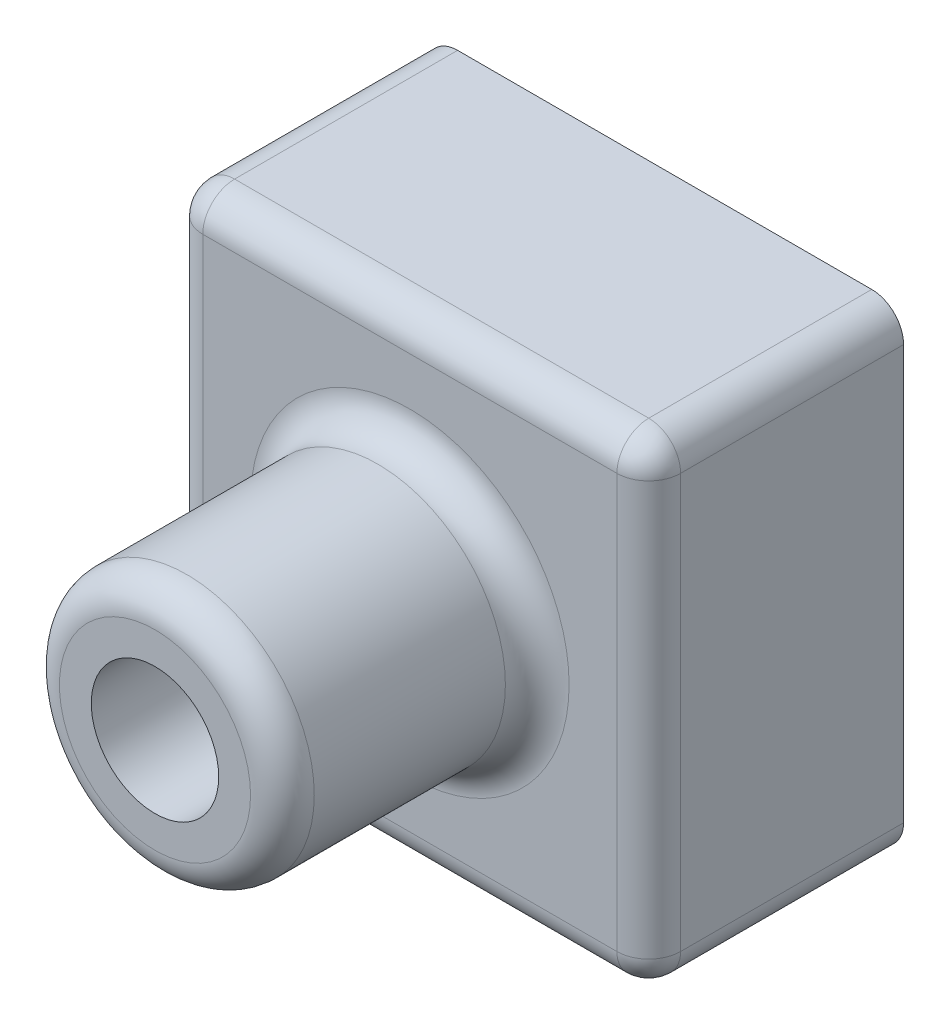
ISO-10303-21;
HEADER;
FILE_DESCRIPTION(('STEP AP214'),'2;1');
FILE_NAME('part.step','',(''),(''),'','','');
FILE_SCHEMA(('AUTOMOTIVE_DESIGN { 1 0 10303 214 1 1 1 1 }'));
ENDSEC;
DATA;
#1=APPLICATION_CONTEXT('core data for automotive mechanical design processes');
#2=APPLICATION_PROTOCOL_DEFINITION('international standard','automotive_design',2000,#1);
#3=PRODUCT_CONTEXT('',#1,'mechanical');
#4=PRODUCT('Part','Part','',(#3));
#5=PRODUCT_RELATED_PRODUCT_CATEGORY('part','',(#4));
#6=PRODUCT_DEFINITION_FORMATION('','',#4);
#7=PRODUCT_DEFINITION_CONTEXT('part definition',#1,'design');
#8=PRODUCT_DEFINITION('design','',#6,#7);
#9=PRODUCT_DEFINITION_SHAPE('','',#8);
#10=(LENGTH_UNIT() NAMED_UNIT(*) SI_UNIT(.MILLI.,.METRE.));
#11=(NAMED_UNIT(*) PLANE_ANGLE_UNIT() SI_UNIT($,.RADIAN.));
#12=(NAMED_UNIT(*) SI_UNIT($,.STERADIAN.) SOLID_ANGLE_UNIT());
#13=UNCERTAINTY_MEASURE_WITH_UNIT(LENGTH_MEASURE(1.E-05),#10,'distance_accuracy_value','');
#14=(GEOMETRIC_REPRESENTATION_CONTEXT(3) GLOBAL_UNCERTAINTY_ASSIGNED_CONTEXT((#13)) GLOBAL_UNIT_ASSIGNED_CONTEXT((#10,
#11,#12)) REPRESENTATION_CONTEXT('',''));
#15=CARTESIAN_POINT('',(0.,0.,0.));
#16=DIRECTION('',(0.,0.,1.));
#17=DIRECTION('',(1.,0.,0.));
#18=AXIS2_PLACEMENT_3D('',#15,#16,#17);
#19=CARTESIAN_POINT('',(37.5,37.5,40.));
#20=DIRECTION('',(-1.,0.,0.));
#21=DIRECTION('',(0.,0.,1.));
#22=AXIS2_PLACEMENT_3D('',#19,#20,#21);
#23=PLANE('',#22);
#24=DIRECTION('',(0.,1.,0.));
#25=VECTOR('',#24,1.);
#26=CARTESIAN_POINT('',(37.5,37.5,0.));
#27=LINE('',#26,#25);
#28=CARTESIAN_POINT('',(37.5,-32.5,0.));
#29=VERTEX_POINT('',#28);
#30=CARTESIAN_POINT('',(37.5,32.5,0.));
#31=VERTEX_POINT('',#30);
#32=EDGE_CURVE('E225',#29,#31,#27,.T.);
#33=ORIENTED_EDGE('',*,*,#32,.T.);
#34=DIRECTION('',(0.,0.,-1.));
#35=VECTOR('',#34,1.);
#36=CARTESIAN_POINT('',(37.5,32.5,40.));
#37=LINE('',#36,#35);
#38=CARTESIAN_POINT('',(37.5,32.5,35.));
#39=VERTEX_POINT('',#38);
#40=EDGE_CURVE('E249',#31,#39,#37,.F.);
#41=ORIENTED_EDGE('',*,*,#40,.T.);
#42=DIRECTION('',(0.,1.,0.));
#43=VECTOR('',#42,1.);
#44=CARTESIAN_POINT('',(37.5,-37.5,35.));
#45=LINE('',#44,#43);
#46=CARTESIAN_POINT('',(37.5,-32.5,35.));
#47=VERTEX_POINT('',#46);
#48=EDGE_CURVE('E245',#39,#47,#45,.F.);
#49=ORIENTED_EDGE('',*,*,#48,.T.);
#50=DIRECTION('',(0.,0.,-1.));
#51=VECTOR('',#50,1.);
#52=CARTESIAN_POINT('',(37.5,-32.5,40.));
#53=LINE('',#52,#51);
#54=EDGE_CURVE('E247',#47,#29,#53,.T.);
#55=ORIENTED_EDGE('',*,*,#54,.T.);
#56=EDGE_LOOP('',(#33,#41,#49,#55));
#57=FACE_BOUND('',#56,.T.);
#58=ADVANCED_FACE('F38',(#57),#23,.F.);
#59=CARTESIAN_POINT('',(-37.5,37.5,40.));
#60=DIRECTION('',(0.,-1.,0.));
#61=DIRECTION('',(0.,0.,-1.));
#62=AXIS2_PLACEMENT_3D('',#59,#60,#61);
#63=PLANE('',#62);
#64=DIRECTION('',(-1.,0.,0.));
#65=VECTOR('',#64,1.);
#66=CARTESIAN_POINT('',(-37.5,37.5,0.));
#67=LINE('',#66,#65);
#68=CARTESIAN_POINT('',(32.5,37.5,0.));
#69=VERTEX_POINT('',#68);
#70=CARTESIAN_POINT('',(-32.5,37.5,0.));
#71=VERTEX_POINT('',#70);
#72=EDGE_CURVE('E221',#69,#71,#67,.T.);
#73=ORIENTED_EDGE('',*,*,#72,.T.);
#74=DIRECTION('',(0.,0.,-1.));
#75=VECTOR('',#74,1.);
#76=CARTESIAN_POINT('',(-32.5,37.5,40.));
#77=LINE('',#76,#75);
#78=CARTESIAN_POINT('',(-32.5,37.5,35.));
#79=VERTEX_POINT('',#78);
#80=EDGE_CURVE('E198',#71,#79,#77,.F.);
#81=ORIENTED_EDGE('',*,*,#80,.T.);
#82=DIRECTION('',(-1.,0.,0.));
#83=VECTOR('',#82,1.);
#84=CARTESIAN_POINT('',(37.5,37.5,35.));
#85=LINE('',#84,#83);
#86=CARTESIAN_POINT('',(32.5,37.5,35.));
#87=VERTEX_POINT('',#86);
#88=EDGE_CURVE('E203',#79,#87,#85,.F.);
#89=ORIENTED_EDGE('',*,*,#88,.T.);
#90=DIRECTION('',(0.,0.,-1.));
#91=VECTOR('',#90,1.);
#92=CARTESIAN_POINT('',(32.5,37.5,40.));
#93=LINE('',#92,#91);
#94=EDGE_CURVE('E236',#87,#69,#93,.T.);
#95=ORIENTED_EDGE('',*,*,#94,.T.);
#96=EDGE_LOOP('',(#73,#81,#89,#95));
#97=FACE_BOUND('',#96,.T.);
#98=ADVANCED_FACE('F862',(#97),#63,.F.);
#99=CARTESIAN_POINT('',(-37.5,37.5,40.));
#100=DIRECTION('',(1.,0.,0.));
#101=DIRECTION('',(0.,1.,0.));
#102=AXIS2_PLACEMENT_3D('',#99,#100,#101);
#103=PLANE('',#102);
#104=DIRECTION('',(0.,-1.,0.));
#105=VECTOR('',#104,1.);
#106=CARTESIAN_POINT('',(-37.5,37.5,35.));
#107=LINE('',#106,#105);
#108=CARTESIAN_POINT('',(-37.5,-32.5,35.));
#109=VERTEX_POINT('',#108);
#110=CARTESIAN_POINT('',(-37.5,32.5,35.));
#111=VERTEX_POINT('',#110);
#112=EDGE_CURVE('E212',#109,#111,#107,.F.);
#113=ORIENTED_EDGE('',*,*,#112,.T.);
#114=DIRECTION('',(0.,0.,-1.));
#115=VECTOR('',#114,1.);
#116=CARTESIAN_POINT('',(-37.5,32.5,40.));
#117=LINE('',#116,#115);
#118=CARTESIAN_POINT('',(-37.5,32.5,0.));
#119=VERTEX_POINT('',#118);
#120=EDGE_CURVE('E197',#111,#119,#117,.T.);
#121=ORIENTED_EDGE('',*,*,#120,.T.);
#122=DIRECTION('',(0.,-1.,0.));
#123=VECTOR('',#122,1.);
#124=CARTESIAN_POINT('',(-37.5,37.5,0.));
#125=LINE('',#124,#123);
#126=CARTESIAN_POINT('',(-37.5,-32.5,0.));
#127=VERTEX_POINT('',#126);
#128=EDGE_CURVE('E209',#119,#127,#125,.T.);
#129=ORIENTED_EDGE('',*,*,#128,.T.);
#130=DIRECTION('',(0.,0.,-1.));
#131=VECTOR('',#130,1.);
#132=CARTESIAN_POINT('',(-37.5,-32.5,40.));
#133=LINE('',#132,#131);
#134=EDGE_CURVE('E215',#127,#109,#133,.F.);
#135=ORIENTED_EDGE('',*,*,#134,.T.);
#136=EDGE_LOOP('',(#113,#121,#129,#135));
#137=FACE_BOUND('',#136,.T.);
#138=ADVANCED_FACE('F208',(#137),#103,.F.);
#139=CARTESIAN_POINT('',(-37.5,-37.5,40.));
#140=DIRECTION('',(0.,1.,0.));
#141=DIRECTION('',(0.,0.,1.));
#142=AXIS2_PLACEMENT_3D('',#139,#140,#141);
#143=PLANE('',#142);
#144=DIRECTION('',(1.,0.,0.));
#145=VECTOR('',#144,1.);
#146=CARTESIAN_POINT('',(-37.5,-37.5,35.));
#147=LINE('',#146,#145);
#148=CARTESIAN_POINT('',(32.5,-37.5,35.));
#149=VERTEX_POINT('',#148);
#150=CARTESIAN_POINT('',(-32.5,-37.5,35.));
#151=VERTEX_POINT('',#150);
#152=EDGE_CURVE('E239',#149,#151,#147,.F.);
#153=ORIENTED_EDGE('',*,*,#152,.T.);
#154=DIRECTION('',(0.,0.,-1.));
#155=VECTOR('',#154,1.);
#156=CARTESIAN_POINT('',(-32.5,-37.5,40.));
#157=LINE('',#156,#155);
#158=CARTESIAN_POINT('',(-32.5,-37.5,0.));
#159=VERTEX_POINT('',#158);
#160=EDGE_CURVE('E243',#151,#159,#157,.T.);
#161=ORIENTED_EDGE('',*,*,#160,.T.);
#162=DIRECTION('',(1.,0.,0.));
#163=VECTOR('',#162,1.);
#164=CARTESIAN_POINT('',(-37.5,-37.5,0.));
#165=LINE('',#164,#163);
#166=CARTESIAN_POINT('',(32.5,-37.5,0.));
#167=VERTEX_POINT('',#166);
#168=EDGE_CURVE('E220',#159,#167,#165,.T.);
#169=ORIENTED_EDGE('',*,*,#168,.T.);
#170=DIRECTION('',(0.,0.,-1.));
#171=VECTOR('',#170,1.);
#172=CARTESIAN_POINT('',(32.5,-37.5,40.));
#173=LINE('',#172,#171);
#174=EDGE_CURVE('E241',#167,#149,#173,.F.);
#175=ORIENTED_EDGE('',*,*,#174,.T.);
#176=EDGE_LOOP('',(#153,#161,#169,#175));
#177=FACE_BOUND('',#176,.T.);
#178=ADVANCED_FACE('F844',(#177),#143,.F.);
#179=CARTESIAN_POINT('',(0.,0.,40.));
#180=DIRECTION('',(0.,0.,1.));
#181=DIRECTION('',(1.,0.,0.));
#182=AXIS2_PLACEMENT_3D('',#179,#180,#181);
#183=PLANE('',#182);
#184=DIRECTION('',(-1.,0.,0.));
#185=VECTOR('',#184,1.);
#186=CARTESIAN_POINT('',(-37.5,32.5,40.));
#187=LINE('',#186,#185);
#188=CARTESIAN_POINT('',(32.5,32.5,40.));
#189=VERTEX_POINT('',#188);
#190=CARTESIAN_POINT('',(-32.5,32.5,40.));
#191=VERTEX_POINT('',#190);
#192=EDGE_CURVE('E131',#189,#191,#187,.T.);
#193=ORIENTED_EDGE('',*,*,#192,.T.);
#194=DIRECTION('',(0.,-1.,0.));
#195=VECTOR('',#194,1.);
#196=CARTESIAN_POINT('',(-32.5,-37.5,40.));
#197=LINE('',#196,#195);
#198=CARTESIAN_POINT('',(-32.5,-32.5,40.));
#199=VERTEX_POINT('',#198);
#200=EDGE_CURVE('E258',#191,#199,#197,.T.);
#201=ORIENTED_EDGE('',*,*,#200,.T.);
#202=DIRECTION('',(1.,0.,0.));
#203=VECTOR('',#202,1.);
#204=CARTESIAN_POINT('',(37.5,-32.5,40.));
#205=LINE('',#204,#203);
#206=CARTESIAN_POINT('',(32.5,-32.5,40.));
#207=VERTEX_POINT('',#206);
#208=EDGE_CURVE('E254',#199,#207,#205,.T.);
#209=ORIENTED_EDGE('',*,*,#208,.T.);
#210=DIRECTION('',(0.,1.,0.));
#211=VECTOR('',#210,1.);
#212=CARTESIAN_POINT('',(32.5,37.5,40.));
#213=LINE('',#212,#211);
#214=EDGE_CURVE('E136',#207,#189,#213,.T.);
#215=ORIENTED_EDGE('',*,*,#214,.T.);
#216=EDGE_LOOP('',(#193,#201,#209,#215));
#217=FACE_BOUND('',#216,.T.);
#218=CARTESIAN_POINT('',(0.,0.,40.));
#219=DIRECTION('',(0.,0.,1.));
#220=DIRECTION('',(1.,0.,0.));
#221=AXIS2_PLACEMENT_3D('',#218,#219,#220);
#222=CIRCLE('',#221,25.);
#223=CARTESIAN_POINT('',(25.,0.,40.));
#224=VERTEX_POINT('',#223);
#225=EDGE_CURVE('E251',#224,#224,#222,.F.);
#226=ORIENTED_EDGE('',*,*,#225,.T.);
#227=EDGE_LOOP('',(#226));
#228=FACE_BOUND('',#227,.T.);
#229=ADVANCED_FACE('F697',(#217,#228),#183,.T.);
#230=CARTESIAN_POINT('',(0.,0.,0.));
#231=DIRECTION('',(0.,0.,1.));
#232=DIRECTION('',(1.,0.,0.));
#233=AXIS2_PLACEMENT_3D('',#230,#231,#232);
#234=PLANE('',#233);
#235=CARTESIAN_POINT('',(0.,0.,0.));
#236=DIRECTION('',(0.,0.,1.));
#237=DIRECTION('',(1.,0.,0.));
#238=AXIS2_PLACEMENT_3D('',#235,#236,#237);
#239=CIRCLE('',#238,10.);
#240=CARTESIAN_POINT('',(10.,0.,0.));
#241=VERTEX_POINT('',#240);
#242=EDGE_CURVE('E272',#241,#241,#239,.T.);
#243=ORIENTED_EDGE('',*,*,#242,.T.);
#244=EDGE_LOOP('',(#243));
#245=FACE_BOUND('',#244,.T.);
#246=ORIENTED_EDGE('',*,*,#128,.F.);
#247=CARTESIAN_POINT('',(-32.5,32.5,0.));
#248=DIRECTION('',(0.,0.,1.));
#249=DIRECTION('',(1.,0.,0.));
#250=AXIS2_PLACEMENT_3D('',#247,#248,#249);
#251=CIRCLE('',#250,5.);
#252=EDGE_CURVE('E193',#119,#71,#251,.F.);
#253=ORIENTED_EDGE('',*,*,#252,.T.);
#254=ORIENTED_EDGE('',*,*,#72,.F.);
#255=CARTESIAN_POINT('',(32.5,32.5,0.));
#256=DIRECTION('',(0.,0.,1.));
#257=DIRECTION('',(1.,0.,0.));
#258=AXIS2_PLACEMENT_3D('',#255,#256,#257);
#259=CIRCLE('',#258,5.);
#260=EDGE_CURVE('E232',#69,#31,#259,.F.);
#261=ORIENTED_EDGE('',*,*,#260,.T.);
#262=ORIENTED_EDGE('',*,*,#32,.F.);
#263=CARTESIAN_POINT('',(32.5,-32.5,0.));
#264=DIRECTION('',(0.,0.,1.));
#265=DIRECTION('',(1.,0.,0.));
#266=AXIS2_PLACEMENT_3D('',#263,#264,#265);
#267=CIRCLE('',#266,5.);
#268=EDGE_CURVE('E214',#29,#167,#267,.F.);
#269=ORIENTED_EDGE('',*,*,#268,.T.);
#270=ORIENTED_EDGE('',*,*,#168,.F.);
#271=CARTESIAN_POINT('',(-32.5,-32.5,0.));
#272=DIRECTION('',(0.,0.,1.));
#273=DIRECTION('',(1.,0.,0.));
#274=AXIS2_PLACEMENT_3D('',#271,#272,#273);
#275=CIRCLE('',#274,5.);
#276=EDGE_CURVE('E204',#159,#127,#275,.F.);
#277=ORIENTED_EDGE('',*,*,#276,.T.);
#278=EDGE_LOOP('',(#246,#253,#254,#261,#262,#269,#270,#277));
#279=FACE_BOUND('',#278,.T.);
#280=ADVANCED_FACE('F217',(#245,#279),#234,.F.);
#281=CARTESIAN_POINT('',(0.,0.,80.));
#282=DIRECTION('',(0.,0.,-1.));
#283=DIRECTION('',(-1.,0.,0.));
#284=AXIS2_PLACEMENT_3D('',#281,#282,#283);
#285=CYLINDRICAL_SURFACE('',#284,20.);
#286=CARTESIAN_POINT('',(0.,0.,45.));
#287=DIRECTION('',(0.,0.,1.));
#288=DIRECTION('',(1.,0.,0.));
#289=AXIS2_PLACEMENT_3D('',#286,#287,#288);
#290=CIRCLE('',#289,20.);
#291=CARTESIAN_POINT('',(20.,0.,45.));
#292=VERTEX_POINT('',#291);
#293=EDGE_CURVE('E263',#292,#292,#290,.T.);
#294=ORIENTED_EDGE('',*,*,#293,.T.);
#295=EDGE_LOOP('',(#294));
#296=FACE_BOUND('',#295,.T.);
#297=CARTESIAN_POINT('',(0.,0.,75.));
#298=DIRECTION('',(0.,0.,1.));
#299=DIRECTION('',(1.,0.,0.));
#300=AXIS2_PLACEMENT_3D('',#297,#298,#299);
#301=CIRCLE('',#300,20.);
#302=CARTESIAN_POINT('',(20.,0.,75.));
#303=VERTEX_POINT('',#302);
#304=EDGE_CURVE('E260',#303,#303,#301,.F.);
#305=ORIENTED_EDGE('',*,*,#304,.T.);
#306=EDGE_LOOP('',(#305));
#307=FACE_BOUND('',#306,.T.);
#308=ADVANCED_FACE('F683',(#296,#307),#285,.T.);
#309=CARTESIAN_POINT('',(0.,0.,80.));
#310=DIRECTION('',(0.,0.,1.));
#311=DIRECTION('',(1.,0.,0.));
#312=AXIS2_PLACEMENT_3D('',#309,#310,#311);
#313=PLANE('',#312);
#314=CARTESIAN_POINT('',(0.,0.,80.));
#315=DIRECTION('',(0.,0.,1.));
#316=DIRECTION('',(1.,0.,0.));
#317=AXIS2_PLACEMENT_3D('',#314,#315,#316);
#318=CIRCLE('',#317,10.);
#319=CARTESIAN_POINT('',(10.,0.,80.));
#320=VERTEX_POINT('',#319);
#321=EDGE_CURVE('E917',#320,#320,#318,.T.);
#322=ORIENTED_EDGE('',*,*,#321,.F.);
#323=EDGE_LOOP('',(#322));
#324=FACE_BOUND('',#323,.T.);
#325=CARTESIAN_POINT('',(0.,0.,80.));
#326=DIRECTION('',(0.,0.,1.));
#327=DIRECTION('',(1.,0.,0.));
#328=AXIS2_PLACEMENT_3D('',#325,#326,#327);
#329=CIRCLE('',#328,15.);
#330=CARTESIAN_POINT('',(15.,0.,80.));
#331=VERTEX_POINT('',#330);
#332=EDGE_CURVE('E266',#331,#331,#329,.T.);
#333=ORIENTED_EDGE('',*,*,#332,.T.);
#334=EDGE_LOOP('',(#333));
#335=FACE_BOUND('',#334,.T.);
#336=ADVANCED_FACE('F677',(#324,#335),#313,.T.);
#337=CARTESIAN_POINT('',(32.5,-32.5,40.));
#338=DIRECTION('',(0.,0.,-1.));
#339=DIRECTION('',(-1.,0.,0.));
#340=AXIS2_PLACEMENT_3D('',#337,#338,#339);
#341=CYLINDRICAL_SURFACE('',#340,5.);
#342=CARTESIAN_POINT('',(32.5,-32.5,35.));
#343=DIRECTION('',(0.,0.,1.));
#344=DIRECTION('',(1.,0.,0.));
#345=AXIS2_PLACEMENT_3D('',#342,#343,#344);
#346=CIRCLE('',#345,5.);
#347=EDGE_CURVE('E301',#149,#47,#346,.T.);
#348=ORIENTED_EDGE('',*,*,#347,.F.);
#349=ORIENTED_EDGE('',*,*,#174,.F.);
#350=ORIENTED_EDGE('',*,*,#268,.F.);
#351=ORIENTED_EDGE('',*,*,#54,.F.);
#352=EDGE_LOOP('',(#348,#349,#350,#351));
#353=FACE_BOUND('',#352,.T.);
#354=ADVANCED_FACE('F682',(#353),#341,.T.);
#355=CARTESIAN_POINT('',(32.5,-32.5,35.));
#356=DIRECTION('',(0.,0.,1.));
#357=DIRECTION('',(1.,0.,0.));
#358=AXIS2_PLACEMENT_3D('',#355,#356,#357);
#359=SPHERICAL_SURFACE('',#358,5.);
#360=CARTESIAN_POINT('',(32.5,-32.5,35.));
#361=DIRECTION('',(1.,0.,0.));
#362=DIRECTION('',(0.,0.,-1.));
#363=AXIS2_PLACEMENT_3D('',#360,#361,#362);
#364=CIRCLE('',#363,5.);
#365=EDGE_CURVE('E295',#149,#207,#364,.F.);
#366=ORIENTED_EDGE('',*,*,#365,.F.);
#367=ORIENTED_EDGE('',*,*,#347,.T.);
#368=CARTESIAN_POINT('',(32.5,-32.5,35.));
#369=DIRECTION('',(0.,-1.,0.));
#370=DIRECTION('',(0.,0.,-1.));
#371=AXIS2_PLACEMENT_3D('',#368,#369,#370);
#372=CIRCLE('',#371,5.);
#373=EDGE_CURVE('E298',#207,#47,#372,.F.);
#374=ORIENTED_EDGE('',*,*,#373,.F.);
#375=EDGE_LOOP('',(#366,#367,#374));
#376=FACE_BOUND('',#375,.T.);
#377=ADVANCED_FACE('F813',(#376),#359,.T.);
#378=CARTESIAN_POINT('',(32.5,32.5,40.));
#379=DIRECTION('',(0.,0.,-1.));
#380=DIRECTION('',(-1.,0.,0.));
#381=AXIS2_PLACEMENT_3D('',#378,#379,#380);
#382=CYLINDRICAL_SURFACE('',#381,5.);
#383=ORIENTED_EDGE('',*,*,#260,.F.);
#384=ORIENTED_EDGE('',*,*,#94,.F.);
#385=CARTESIAN_POINT('',(32.5,32.5,35.));
#386=DIRECTION('',(0.,0.,1.));
#387=DIRECTION('',(1.,0.,0.));
#388=AXIS2_PLACEMENT_3D('',#385,#386,#387);
#389=CIRCLE('',#388,5.);
#390=EDGE_CURVE('E292',#39,#87,#389,.T.);
#391=ORIENTED_EDGE('',*,*,#390,.F.);
#392=ORIENTED_EDGE('',*,*,#40,.F.);
#393=EDGE_LOOP('',(#383,#384,#391,#392));
#394=FACE_BOUND('',#393,.T.);
#395=ADVANCED_FACE('F803',(#394),#382,.T.);
#396=CARTESIAN_POINT('',(32.5,0.,35.));
#397=DIRECTION('',(0.,-1.,0.));
#398=DIRECTION('',(0.,0.,-1.));
#399=AXIS2_PLACEMENT_3D('',#396,#397,#398);
#400=CYLINDRICAL_SURFACE('',#399,5.);
#401=ORIENTED_EDGE('',*,*,#373,.T.);
#402=ORIENTED_EDGE('',*,*,#48,.F.);
#403=CARTESIAN_POINT('',(32.5,32.5,35.));
#404=DIRECTION('',(0.,1.,0.));
#405=DIRECTION('',(0.,0.,1.));
#406=AXIS2_PLACEMENT_3D('',#403,#404,#405);
#407=CIRCLE('',#406,5.);
#408=EDGE_CURVE('E289',#189,#39,#407,.T.);
#409=ORIENTED_EDGE('',*,*,#408,.F.);
#410=ORIENTED_EDGE('',*,*,#214,.F.);
#411=EDGE_LOOP('',(#401,#402,#409,#410));
#412=FACE_BOUND('',#411,.T.);
#413=ADVANCED_FACE('F793',(#412),#400,.T.);
#414=CARTESIAN_POINT('',(0.,-32.5,35.));
#415=DIRECTION('',(-1.,0.,0.));
#416=DIRECTION('',(0.,0.,1.));
#417=AXIS2_PLACEMENT_3D('',#414,#415,#416);
#418=CYLINDRICAL_SURFACE('',#417,5.);
#419=ORIENTED_EDGE('',*,*,#365,.T.);
#420=ORIENTED_EDGE('',*,*,#208,.F.);
#421=CARTESIAN_POINT('',(-32.5,-32.5,35.));
#422=DIRECTION('',(-1.,0.,0.));
#423=DIRECTION('',(0.,0.,1.));
#424=AXIS2_PLACEMENT_3D('',#421,#422,#423);
#425=CIRCLE('',#424,5.);
#426=EDGE_CURVE('E286',#151,#199,#425,.T.);
#427=ORIENTED_EDGE('',*,*,#426,.F.);
#428=ORIENTED_EDGE('',*,*,#152,.F.);
#429=EDGE_LOOP('',(#419,#420,#427,#428));
#430=FACE_BOUND('',#429,.T.);
#431=ADVANCED_FACE('F783',(#430),#418,.T.);
#432=CARTESIAN_POINT('',(-32.5,-32.5,40.));
#433=DIRECTION('',(0.,0.,-1.));
#434=DIRECTION('',(-1.,0.,0.));
#435=AXIS2_PLACEMENT_3D('',#432,#433,#434);
#436=CYLINDRICAL_SURFACE('',#435,5.);
#437=ORIENTED_EDGE('',*,*,#276,.F.);
#438=ORIENTED_EDGE('',*,*,#160,.F.);
#439=CARTESIAN_POINT('',(-32.5,-32.5,35.));
#440=DIRECTION('',(0.,0.,1.));
#441=DIRECTION('',(1.,0.,0.));
#442=AXIS2_PLACEMENT_3D('',#439,#440,#441);
#443=CIRCLE('',#442,5.);
#444=EDGE_CURVE('E283',#109,#151,#443,.T.);
#445=ORIENTED_EDGE('',*,*,#444,.F.);
#446=ORIENTED_EDGE('',*,*,#134,.F.);
#447=EDGE_LOOP('',(#437,#438,#445,#446));
#448=FACE_BOUND('',#447,.T.);
#449=ADVANCED_FACE('F773',(#448),#436,.T.);
#450=CARTESIAN_POINT('',(32.5,32.5,35.));
#451=DIRECTION('',(0.,0.,1.));
#452=DIRECTION('',(1.,0.,0.));
#453=AXIS2_PLACEMENT_3D('',#450,#451,#452);
#454=SPHERICAL_SURFACE('',#453,5.);
#455=ORIENTED_EDGE('',*,*,#408,.T.);
#456=ORIENTED_EDGE('',*,*,#390,.T.);
#457=CARTESIAN_POINT('',(32.5,32.5,35.));
#458=DIRECTION('',(1.,0.,0.));
#459=DIRECTION('',(0.,0.,-1.));
#460=AXIS2_PLACEMENT_3D('',#457,#458,#459);
#461=CIRCLE('',#460,5.);
#462=EDGE_CURVE('E280',#189,#87,#461,.F.);
#463=ORIENTED_EDGE('',*,*,#462,.F.);
#464=EDGE_LOOP('',(#455,#456,#463));
#465=FACE_BOUND('',#464,.T.);
#466=ADVANCED_FACE('F763',(#465),#454,.T.);
#467=CARTESIAN_POINT('',(-32.5,-32.5,35.));
#468=DIRECTION('',(0.,0.,1.));
#469=DIRECTION('',(1.,0.,0.));
#470=AXIS2_PLACEMENT_3D('',#467,#468,#469);
#471=SPHERICAL_SURFACE('',#470,5.);
#472=ORIENTED_EDGE('',*,*,#444,.T.);
#473=ORIENTED_EDGE('',*,*,#426,.T.);
#474=CARTESIAN_POINT('',(-32.5,-32.5,35.));
#475=DIRECTION('',(0.,-1.,0.));
#476=DIRECTION('',(0.,0.,-1.));
#477=AXIS2_PLACEMENT_3D('',#474,#475,#476);
#478=CIRCLE('',#477,5.);
#479=EDGE_CURVE('E278',#109,#199,#478,.F.);
#480=ORIENTED_EDGE('',*,*,#479,.F.);
#481=EDGE_LOOP('',(#472,#473,#480));
#482=FACE_BOUND('',#481,.T.);
#483=ADVANCED_FACE('F753',(#482),#471,.T.);
#484=CARTESIAN_POINT('',(0.,32.5,35.));
#485=DIRECTION('',(1.,0.,0.));
#486=DIRECTION('',(0.,0.,-1.));
#487=AXIS2_PLACEMENT_3D('',#484,#485,#486);
#488=CYLINDRICAL_SURFACE('',#487,5.);
#489=ORIENTED_EDGE('',*,*,#462,.T.);
#490=ORIENTED_EDGE('',*,*,#88,.F.);
#491=CARTESIAN_POINT('',(-32.5,32.5,35.));
#492=DIRECTION('',(-1.,0.,0.));
#493=DIRECTION('',(0.,0.,1.));
#494=AXIS2_PLACEMENT_3D('',#491,#492,#493);
#495=CIRCLE('',#494,5.);
#496=EDGE_CURVE('E275',#191,#79,#495,.T.);
#497=ORIENTED_EDGE('',*,*,#496,.F.);
#498=ORIENTED_EDGE('',*,*,#192,.F.);
#499=EDGE_LOOP('',(#489,#490,#497,#498));
#500=FACE_BOUND('',#499,.T.);
#501=ADVANCED_FACE('F743',(#500),#488,.T.);
#502=CARTESIAN_POINT('',(-32.5,0.,35.));
#503=DIRECTION('',(0.,1.,0.));
#504=DIRECTION('',(-1.,0.,0.));
#505=AXIS2_PLACEMENT_3D('',#502,#503,#504);
#506=CYLINDRICAL_SURFACE('',#505,5.);
#507=ORIENTED_EDGE('',*,*,#479,.T.);
#508=ORIENTED_EDGE('',*,*,#200,.F.);
#509=CARTESIAN_POINT('',(-32.5,32.5,35.));
#510=DIRECTION('',(0.,1.,0.));
#511=DIRECTION('',(0.,0.,1.));
#512=AXIS2_PLACEMENT_3D('',#509,#510,#511);
#513=CIRCLE('',#512,5.);
#514=EDGE_CURVE('E271',#111,#191,#513,.T.);
#515=ORIENTED_EDGE('',*,*,#514,.F.);
#516=ORIENTED_EDGE('',*,*,#112,.F.);
#517=EDGE_LOOP('',(#507,#508,#515,#516));
#518=FACE_BOUND('',#517,.T.);
#519=ADVANCED_FACE('F733',(#518),#506,.T.);
#520=CARTESIAN_POINT('',(-32.5,32.5,35.));
#521=DIRECTION('',(0.,0.,1.));
#522=DIRECTION('',(1.,0.,0.));
#523=AXIS2_PLACEMENT_3D('',#520,#521,#522);
#524=SPHERICAL_SURFACE('',#523,5.);
#525=ORIENTED_EDGE('',*,*,#514,.T.);
#526=ORIENTED_EDGE('',*,*,#496,.T.);
#527=CARTESIAN_POINT('',(-32.5,32.5,35.));
#528=DIRECTION('',(0.,0.,1.));
#529=DIRECTION('',(1.,0.,0.));
#530=AXIS2_PLACEMENT_3D('',#527,#528,#529);
#531=CIRCLE('',#530,5.);
#532=EDGE_CURVE('E269',#111,#79,#531,.F.);
#533=ORIENTED_EDGE('',*,*,#532,.F.);
#534=EDGE_LOOP('',(#525,#526,#533));
#535=FACE_BOUND('',#534,.T.);
#536=ADVANCED_FACE('F724',(#535),#524,.T.);
#537=CARTESIAN_POINT('',(-32.5,32.5,40.));
#538=DIRECTION('',(0.,0.,-1.));
#539=DIRECTION('',(-1.,0.,0.));
#540=AXIS2_PLACEMENT_3D('',#537,#538,#539);
#541=CYLINDRICAL_SURFACE('',#540,5.);
#542=ORIENTED_EDGE('',*,*,#532,.T.);
#543=ORIENTED_EDGE('',*,*,#80,.F.);
#544=ORIENTED_EDGE('',*,*,#252,.F.);
#545=ORIENTED_EDGE('',*,*,#120,.F.);
#546=EDGE_LOOP('',(#542,#543,#544,#545));
#547=FACE_BOUND('',#546,.T.);
#548=ADVANCED_FACE('F196',(#547),#541,.T.);
#549=CARTESIAN_POINT('',(0.,0.,45.));
#550=DIRECTION('',(0.,0.,1.));
#551=DIRECTION('',(1.,0.,0.));
#552=AXIS2_PLACEMENT_3D('',#549,#550,#551);
#553=TOROIDAL_SURFACE('',#552,25.,5.);
#554=ORIENTED_EDGE('',*,*,#225,.F.);
#555=EDGE_LOOP('',(#554));
#556=FACE_BOUND('',#555,.T.);
#557=ORIENTED_EDGE('',*,*,#293,.F.);
#558=EDGE_LOOP('',(#557));
#559=FACE_BOUND('',#558,.T.);
#560=ADVANCED_FACE('F707',(#556,#559),#553,.F.);
#561=CARTESIAN_POINT('',(0.,0.,75.));
#562=DIRECTION('',(0.,0.,1.));
#563=DIRECTION('',(1.,0.,0.));
#564=AXIS2_PLACEMENT_3D('',#561,#562,#563);
#565=TOROIDAL_SURFACE('',#564,15.,5.);
#566=ORIENTED_EDGE('',*,*,#304,.F.);
#567=EDGE_LOOP('',(#566));
#568=FACE_BOUND('',#567,.T.);
#569=ORIENTED_EDGE('',*,*,#332,.F.);
#570=EDGE_LOOP('',(#569));
#571=FACE_BOUND('',#570,.T.);
#572=ADVANCED_FACE('F446',(#568,#571),#565,.T.);
#573=CARTESIAN_POINT('',(0.,0.,0.));
#574=DIRECTION('',(0.,0.,1.));
#575=DIRECTION('',(1.,0.,0.));
#576=AXIS2_PLACEMENT_3D('',#573,#574,#575);
#577=CYLINDRICAL_SURFACE('',#576,10.);
#578=ORIENTED_EDGE('',*,*,#242,.F.);
#579=EDGE_LOOP('',(#578));
#580=FACE_BOUND('',#579,.T.);
#581=ORIENTED_EDGE('',*,*,#321,.T.);
#582=EDGE_LOOP('',(#581));
#583=FACE_BOUND('',#582,.T.);
#584=ADVANCED_FACE('F667',(#580,#583),#577,.F.);
#585=CLOSED_SHELL('',(#58,#98,#138,#178,#229,#280,#308,#336,#354,#377,#395,#413,#431,#449,#466,
#483,#501,#519,#536,#548,#560,#572,#584));
#586=CARTESIAN_POINT('',(35.5,37.5,40.));
#587=DIRECTION('',(-1.,0.,0.));
#588=DIRECTION('',(0.,0.,1.));
#589=AXIS2_PLACEMENT_3D('',#586,#587,#588);
#590=PLANE('',#589);
#591=DIRECTION('',(0.,1.,0.));
#592=VECTOR('',#591,1.);
#593=CARTESIAN_POINT('',(35.5,37.5,4.));
#594=LINE('',#593,#592);
#595=CARTESIAN_POINT('',(35.5,-32.5,4.));
#596=VERTEX_POINT('',#595);
#597=CARTESIAN_POINT('',(35.5,32.5,4.));
#598=VERTEX_POINT('',#597);
#599=EDGE_CURVE('E42',#596,#598,#594,.T.);
#600=ORIENTED_EDGE('',*,*,#599,.F.);
#601=DIRECTION('',(0.,0.,1.));
#602=VECTOR('',#601,1.);
#603=CARTESIAN_POINT('',(35.5,-32.5,40.));
#604=LINE('',#603,#602);
#605=CARTESIAN_POINT('',(35.5,-32.5,35.));
#606=VERTEX_POINT('',#605);
#607=EDGE_CURVE('E392',#606,#596,#604,.F.);
#608=ORIENTED_EDGE('',*,*,#607,.F.);
#609=DIRECTION('',(0.,1.,0.));
#610=VECTOR('',#609,1.);
#611=CARTESIAN_POINT('',(35.5,37.5,35.));
#612=LINE('',#611,#610);
#613=CARTESIAN_POINT('',(35.5,32.5,35.));
#614=VERTEX_POINT('',#613);
#615=EDGE_CURVE('E118',#614,#606,#612,.F.);
#616=ORIENTED_EDGE('',*,*,#615,.F.);
#617=DIRECTION('',(0.,0.,1.));
#618=VECTOR('',#617,1.);
#619=CARTESIAN_POINT('',(35.5,32.5,40.));
#620=LINE('',#619,#618);
#621=EDGE_CURVE('E124',#598,#614,#620,.T.);
#622=ORIENTED_EDGE('',*,*,#621,.F.);
#623=EDGE_LOOP('',(#600,#608,#616,#622));
#624=FACE_BOUND('',#623,.T.);
#625=ADVANCED_FACE('F400',(#624),#590,.T.);
#626=CARTESIAN_POINT('',(-37.5,35.5,40.));
#627=DIRECTION('',(0.,-1.,0.));
#628=DIRECTION('',(0.,0.,-1.));
#629=AXIS2_PLACEMENT_3D('',#626,#627,#628);
#630=PLANE('',#629);
#631=DIRECTION('',(-1.,0.,0.));
#632=VECTOR('',#631,1.);
#633=CARTESIAN_POINT('',(-37.5,35.5,4.));
#634=LINE('',#633,#632);
#635=CARTESIAN_POINT('',(32.5,35.5,4.));
#636=VERTEX_POINT('',#635);
#637=CARTESIAN_POINT('',(-32.5,35.5,4.));
#638=VERTEX_POINT('',#637);
#639=EDGE_CURVE('E390',#636,#638,#634,.T.);
#640=ORIENTED_EDGE('',*,*,#639,.F.);
#641=DIRECTION('',(0.,0.,-1.));
#642=VECTOR('',#641,1.);
#643=CARTESIAN_POINT('',(32.5,35.5,40.));
#644=LINE('',#643,#642);
#645=CARTESIAN_POINT('',(32.5,35.5,35.));
#646=VERTEX_POINT('',#645);
#647=EDGE_CURVE('E384',#646,#636,#644,.T.);
#648=ORIENTED_EDGE('',*,*,#647,.F.);
#649=DIRECTION('',(1.,0.,0.));
#650=VECTOR('',#649,1.);
#651=CARTESIAN_POINT('',(-37.5,35.5,35.));
#652=LINE('',#651,#650);
#653=CARTESIAN_POINT('',(-32.5,35.5,35.));
#654=VERTEX_POINT('',#653);
#655=EDGE_CURVE('E386',#654,#646,#652,.T.);
#656=ORIENTED_EDGE('',*,*,#655,.F.);
#657=DIRECTION('',(0.,0.,-1.));
#658=VECTOR('',#657,1.);
#659=CARTESIAN_POINT('',(-32.5,35.5,40.));
#660=LINE('',#659,#658);
#661=EDGE_CURVE('E388',#638,#654,#660,.F.);
#662=ORIENTED_EDGE('',*,*,#661,.F.);
#663=EDGE_LOOP('',(#640,#648,#656,#662));
#664=FACE_BOUND('',#663,.T.);
#665=ADVANCED_FACE('F422',(#664),#630,.T.);
#666=CARTESIAN_POINT('',(-35.5,37.5,40.));
#667=DIRECTION('',(1.,0.,0.));
#668=DIRECTION('',(0.,1.,0.));
#669=AXIS2_PLACEMENT_3D('',#666,#667,#668);
#670=PLANE('',#669);
#671=DIRECTION('',(0.,1.,0.));
#672=VECTOR('',#671,1.);
#673=CARTESIAN_POINT('',(-35.5,37.5,35.));
#674=LINE('',#673,#672);
#675=CARTESIAN_POINT('',(-35.5,-32.5,35.));
#676=VERTEX_POINT('',#675);
#677=CARTESIAN_POINT('',(-35.5,32.5,35.));
#678=VERTEX_POINT('',#677);
#679=EDGE_CURVE('E382',#676,#678,#674,.T.);
#680=ORIENTED_EDGE('',*,*,#679,.F.);
#681=DIRECTION('',(0.,0.,1.));
#682=VECTOR('',#681,1.);
#683=CARTESIAN_POINT('',(-35.5,-32.5,40.));
#684=LINE('',#683,#682);
#685=CARTESIAN_POINT('',(-35.5,-32.5,4.));
#686=VERTEX_POINT('',#685);
#687=EDGE_CURVE('E376',#686,#676,#684,.T.);
#688=ORIENTED_EDGE('',*,*,#687,.F.);
#689=DIRECTION('',(0.,-1.,0.));
#690=VECTOR('',#689,1.);
#691=CARTESIAN_POINT('',(-35.5,37.5,4.));
#692=LINE('',#691,#690);
#693=CARTESIAN_POINT('',(-35.5,32.5,4.));
#694=VERTEX_POINT('',#693);
#695=EDGE_CURVE('E378',#694,#686,#692,.T.);
#696=ORIENTED_EDGE('',*,*,#695,.F.);
#697=DIRECTION('',(0.,0.,1.));
#698=VECTOR('',#697,1.);
#699=CARTESIAN_POINT('',(-35.5,32.5,40.));
#700=LINE('',#699,#698);
#701=EDGE_CURVE('E380',#678,#694,#700,.F.);
#702=ORIENTED_EDGE('',*,*,#701,.F.);
#703=EDGE_LOOP('',(#680,#688,#696,#702));
#704=FACE_BOUND('',#703,.T.);
#705=ADVANCED_FACE('F443',(#704),#670,.T.);
#706=CARTESIAN_POINT('',(-37.5,-35.5,40.));
#707=DIRECTION('',(0.,1.,0.));
#708=DIRECTION('',(0.,0.,1.));
#709=AXIS2_PLACEMENT_3D('',#706,#707,#708);
#710=PLANE('',#709);
#711=DIRECTION('',(1.,0.,0.));
#712=VECTOR('',#711,1.);
#713=CARTESIAN_POINT('',(-37.5,-35.5,35.));
#714=LINE('',#713,#712);
#715=CARTESIAN_POINT('',(32.5,-35.5,35.));
#716=VERTEX_POINT('',#715);
#717=CARTESIAN_POINT('',(-32.5,-35.5,35.));
#718=VERTEX_POINT('',#717);
#719=EDGE_CURVE('E374',#716,#718,#714,.F.);
#720=ORIENTED_EDGE('',*,*,#719,.F.);
#721=DIRECTION('',(0.,0.,1.));
#722=VECTOR('',#721,1.);
#723=CARTESIAN_POINT('',(32.5,-35.5,40.));
#724=LINE('',#723,#722);
#725=CARTESIAN_POINT('',(32.5,-35.5,4.));
#726=VERTEX_POINT('',#725);
#727=EDGE_CURVE('E367',#726,#716,#724,.T.);
#728=ORIENTED_EDGE('',*,*,#727,.F.);
#729=DIRECTION('',(1.,0.,0.));
#730=VECTOR('',#729,1.);
#731=CARTESIAN_POINT('',(-37.5,-35.5,4.));
#732=LINE('',#731,#730);
#733=CARTESIAN_POINT('',(-32.5,-35.5,4.));
#734=VERTEX_POINT('',#733);
#735=EDGE_CURVE('E369',#734,#726,#732,.T.);
#736=ORIENTED_EDGE('',*,*,#735,.F.);
#737=DIRECTION('',(0.,0.,1.));
#738=VECTOR('',#737,1.);
#739=CARTESIAN_POINT('',(-32.5,-35.5,40.));
#740=LINE('',#739,#738);
#741=EDGE_CURVE('E372',#718,#734,#740,.F.);
#742=ORIENTED_EDGE('',*,*,#741,.F.);
#743=EDGE_LOOP('',(#720,#728,#736,#742));
#744=FACE_BOUND('',#743,.T.);
#745=ADVANCED_FACE('F451',(#744),#710,.T.);
#746=CARTESIAN_POINT('',(0.,0.,38.));
#747=DIRECTION('',(0.,0.,1.));
#748=DIRECTION('',(1.,0.,0.));
#749=AXIS2_PLACEMENT_3D('',#746,#747,#748);
#750=PLANE('',#749);
#751=DIRECTION('',(1.,0.,0.));
#752=VECTOR('',#751,1.);
#753=CARTESIAN_POINT('',(0.,32.5,38.));
#754=LINE('',#753,#752);
#755=CARTESIAN_POINT('',(32.5,32.5,38.));
#756=VERTEX_POINT('',#755);
#757=CARTESIAN_POINT('',(-32.5,32.5,38.));
#758=VERTEX_POINT('',#757);
#759=EDGE_CURVE('E365',#756,#758,#754,.F.);
#760=ORIENTED_EDGE('',*,*,#759,.F.);
#761=DIRECTION('',(0.,1.,0.));
#762=VECTOR('',#761,1.);
#763=CARTESIAN_POINT('',(32.5,0.,38.));
#764=LINE('',#763,#762);
#765=CARTESIAN_POINT('',(32.5,-32.5,38.));
#766=VERTEX_POINT('',#765);
#767=EDGE_CURVE('E358',#766,#756,#764,.T.);
#768=ORIENTED_EDGE('',*,*,#767,.F.);
#769=DIRECTION('',(1.,0.,0.));
#770=VECTOR('',#769,1.);
#771=CARTESIAN_POINT('',(0.,-32.5,38.));
#772=LINE('',#771,#770);
#773=CARTESIAN_POINT('',(-32.5,-32.5,38.));
#774=VERTEX_POINT('',#773);
#775=EDGE_CURVE('E360',#774,#766,#772,.T.);
#776=ORIENTED_EDGE('',*,*,#775,.F.);
#777=DIRECTION('',(0.,1.,0.));
#778=VECTOR('',#777,1.);
#779=CARTESIAN_POINT('',(-32.5,0.,38.));
#780=LINE('',#779,#778);
#781=EDGE_CURVE('E362',#758,#774,#780,.F.);
#782=ORIENTED_EDGE('',*,*,#781,.F.);
#783=EDGE_LOOP('',(#760,#768,#776,#782));
#784=FACE_BOUND('',#783,.T.);
#785=CARTESIAN_POINT('',(0.,0.,38.));
#786=DIRECTION('',(0.,0.,1.));
#787=DIRECTION('',(1.,0.,0.));
#788=AXIS2_PLACEMENT_3D('',#785,#786,#787);
#789=CIRCLE('',#788,25.);
#790=CARTESIAN_POINT('',(25.,0.,38.));
#791=VERTEX_POINT('',#790);
#792=EDGE_CURVE('E355',#791,#791,#789,.F.);
#793=ORIENTED_EDGE('',*,*,#792,.F.);
#794=EDGE_LOOP('',(#793));
#795=FACE_BOUND('',#794,.T.);
#796=ADVANCED_FACE('F411',(#784,#795),#750,.F.);
#797=CARTESIAN_POINT('',(0.,0.,4.));
#798=DIRECTION('',(0.,0.,1.));
#799=DIRECTION('',(1.,0.,0.));
#800=AXIS2_PLACEMENT_3D('',#797,#798,#799);
#801=PLANE('',#800);
#802=CARTESIAN_POINT('',(0.,0.,4.));
#803=DIRECTION('',(0.,0.,1.));
#804=DIRECTION('',(1.,0.,0.));
#805=AXIS2_PLACEMENT_3D('',#802,#803,#804);
#806=CIRCLE('',#805,12.);
#807=CARTESIAN_POINT('',(12.,0.,4.));
#808=VERTEX_POINT('',#807);
#809=EDGE_CURVE('E352',#808,#808,#806,.T.);
#810=ORIENTED_EDGE('',*,*,#809,.F.);
#811=EDGE_LOOP('',(#810));
#812=FACE_BOUND('',#811,.T.);
#813=ORIENTED_EDGE('',*,*,#695,.T.);
#814=CARTESIAN_POINT('',(-32.5,-32.5,4.));
#815=DIRECTION('',(0.,0.,1.));
#816=DIRECTION('',(1.,0.,0.));
#817=AXIS2_PLACEMENT_3D('',#814,#815,#816);
#818=CIRCLE('',#817,3.);
#819=EDGE_CURVE('E345',#734,#686,#818,.F.);
#820=ORIENTED_EDGE('',*,*,#819,.F.);
#821=ORIENTED_EDGE('',*,*,#735,.T.);
#822=CARTESIAN_POINT('',(32.5,-32.5,4.));
#823=DIRECTION('',(0.,0.,1.));
#824=DIRECTION('',(1.,0.,0.));
#825=AXIS2_PLACEMENT_3D('',#822,#823,#824);
#826=CIRCLE('',#825,3.);
#827=EDGE_CURVE('E347',#596,#726,#826,.F.);
#828=ORIENTED_EDGE('',*,*,#827,.F.);
#829=ORIENTED_EDGE('',*,*,#599,.T.);
#830=CARTESIAN_POINT('',(32.5,32.5,4.));
#831=DIRECTION('',(0.,0.,1.));
#832=DIRECTION('',(1.,0.,0.));
#833=AXIS2_PLACEMENT_3D('',#830,#831,#832);
#834=CIRCLE('',#833,3.);
#835=EDGE_CURVE('E349',#636,#598,#834,.F.);
#836=ORIENTED_EDGE('',*,*,#835,.F.);
#837=ORIENTED_EDGE('',*,*,#639,.T.);
#838=CARTESIAN_POINT('',(-32.5,32.5,4.));
#839=DIRECTION('',(0.,0.,1.));
#840=DIRECTION('',(1.,0.,0.));
#841=AXIS2_PLACEMENT_3D('',#838,#839,#840);
#842=CIRCLE('',#841,3.);
#843=EDGE_CURVE('E58',#694,#638,#842,.F.);
#844=ORIENTED_EDGE('',*,*,#843,.F.);
#845=EDGE_LOOP('',(#813,#820,#821,#828,#829,#836,#837,#844));
#846=FACE_BOUND('',#845,.T.);
#847=ADVANCED_FACE('F398',(#812,#846),#801,.T.);
#848=CARTESIAN_POINT('',(0.,0.,80.));
#849=DIRECTION('',(0.,0.,-1.));
#850=DIRECTION('',(-1.,0.,0.));
#851=AXIS2_PLACEMENT_3D('',#848,#849,#850);
#852=CYLINDRICAL_SURFACE('',#851,18.);
#853=CARTESIAN_POINT('',(0.,0.,45.));
#854=DIRECTION('',(0.,0.,-1.));
#855=DIRECTION('',(-1.,0.,0.));
#856=AXIS2_PLACEMENT_3D('',#853,#854,#855);
#857=CIRCLE('',#856,18.);
#858=CARTESIAN_POINT('',(-18.,0.,45.));
#859=VERTEX_POINT('',#858);
#860=EDGE_CURVE('E342',#859,#859,#857,.F.);
#861=ORIENTED_EDGE('',*,*,#860,.F.);
#862=EDGE_LOOP('',(#861));
#863=FACE_BOUND('',#862,.T.);
#864=CARTESIAN_POINT('',(0.,0.,75.));
#865=DIRECTION('',(0.,0.,-1.));
#866=DIRECTION('',(-1.,0.,0.));
#867=AXIS2_PLACEMENT_3D('',#864,#865,#866);
#868=CIRCLE('',#867,18.);
#869=CARTESIAN_POINT('',(-18.,0.,75.));
#870=VERTEX_POINT('',#869);
#871=EDGE_CURVE('E339',#870,#870,#868,.T.);
#872=ORIENTED_EDGE('',*,*,#871,.F.);
#873=EDGE_LOOP('',(#872));
#874=FACE_BOUND('',#873,.T.);
#875=ADVANCED_FACE('F460',(#863,#874),#852,.F.);
#876=CARTESIAN_POINT('',(0.,0.,78.));
#877=DIRECTION('',(0.,0.,1.));
#878=DIRECTION('',(1.,0.,0.));
#879=AXIS2_PLACEMENT_3D('',#876,#877,#878);
#880=PLANE('',#879);
#881=CARTESIAN_POINT('',(0.,0.,78.));
#882=DIRECTION('',(0.,0.,1.));
#883=DIRECTION('',(1.,0.,0.));
#884=AXIS2_PLACEMENT_3D('',#881,#882,#883);
#885=CIRCLE('',#884,12.);
#886=CARTESIAN_POINT('',(12.,0.,78.));
#887=VERTEX_POINT('',#886);
#888=EDGE_CURVE('E12',#887,#887,#885,.T.);
#889=ORIENTED_EDGE('',*,*,#888,.T.);
#890=EDGE_LOOP('',(#889));
#891=FACE_BOUND('',#890,.T.);
#892=CARTESIAN_POINT('',(0.,0.,78.));
#893=DIRECTION('',(0.,0.,1.));
#894=DIRECTION('',(1.,0.,0.));
#895=AXIS2_PLACEMENT_3D('',#892,#893,#894);
#896=CIRCLE('',#895,15.);
#897=CARTESIAN_POINT('',(15.,0.,78.));
#898=VERTEX_POINT('',#897);
#899=EDGE_CURVE('E336',#898,#898,#896,.T.);
#900=ORIENTED_EDGE('',*,*,#899,.F.);
#901=EDGE_LOOP('',(#900));
#902=FACE_BOUND('',#901,.T.);
#903=ADVANCED_FACE('F464',(#891,#902),#880,.F.);
#904=CARTESIAN_POINT('',(32.5,-32.5,40.));
#905=DIRECTION('',(0.,0.,-1.));
#906=DIRECTION('',(-1.,0.,0.));
#907=AXIS2_PLACEMENT_3D('',#904,#905,#906);
#908=CYLINDRICAL_SURFACE('',#907,3.);
#909=CARTESIAN_POINT('',(32.5,-32.5,35.));
#910=DIRECTION('',(0.,0.,1.));
#911=DIRECTION('',(1.,0.,0.));
#912=AXIS2_PLACEMENT_3D('',#909,#910,#911);
#913=CIRCLE('',#912,3.);
#914=EDGE_CURVE('E333',#716,#606,#913,.T.);
#915=ORIENTED_EDGE('',*,*,#914,.T.);
#916=ORIENTED_EDGE('',*,*,#607,.T.);
#917=ORIENTED_EDGE('',*,*,#827,.T.);
#918=ORIENTED_EDGE('',*,*,#727,.T.);
#919=EDGE_LOOP('',(#915,#916,#917,#918));
#920=FACE_BOUND('',#919,.T.);
#921=ADVANCED_FACE('F434',(#920),#908,.F.);
#922=CARTESIAN_POINT('',(32.5,-32.5,35.));
#923=DIRECTION('',(0.,0.,1.));
#924=DIRECTION('',(1.,0.,0.));
#925=AXIS2_PLACEMENT_3D('',#922,#923,#924);
#926=SPHERICAL_SURFACE('',#925,3.);
#927=CARTESIAN_POINT('',(32.5,-32.5,35.));
#928=DIRECTION('',(-1.,0.,0.));
#929=DIRECTION('',(0.,0.,1.));
#930=AXIS2_PLACEMENT_3D('',#927,#928,#929);
#931=CIRCLE('',#930,3.);
#932=EDGE_CURVE('E327',#716,#766,#931,.T.);
#933=ORIENTED_EDGE('',*,*,#932,.T.);
#934=CARTESIAN_POINT('',(32.5,-32.5,35.));
#935=DIRECTION('',(0.,-1.,0.));
#936=DIRECTION('',(0.,0.,-1.));
#937=AXIS2_PLACEMENT_3D('',#934,#935,#936);
#938=CIRCLE('',#937,3.);
#939=EDGE_CURVE('E330',#766,#606,#938,.F.);
#940=ORIENTED_EDGE('',*,*,#939,.T.);
#941=ORIENTED_EDGE('',*,*,#914,.F.);
#942=EDGE_LOOP('',(#933,#940,#941));
#943=FACE_BOUND('',#942,.T.);
#944=ADVANCED_FACE('F425',(#943),#926,.F.);
#945=CARTESIAN_POINT('',(32.5,32.5,40.));
#946=DIRECTION('',(0.,0.,-1.));
#947=DIRECTION('',(-1.,0.,0.));
#948=AXIS2_PLACEMENT_3D('',#945,#946,#947);
#949=CYLINDRICAL_SURFACE('',#948,3.);
#950=ORIENTED_EDGE('',*,*,#835,.T.);
#951=ORIENTED_EDGE('',*,*,#621,.T.);
#952=CARTESIAN_POINT('',(32.5,32.5,35.));
#953=DIRECTION('',(0.,0.,1.));
#954=DIRECTION('',(1.,0.,0.));
#955=AXIS2_PLACEMENT_3D('',#952,#953,#954);
#956=CIRCLE('',#955,3.);
#957=EDGE_CURVE('E323',#614,#646,#956,.T.);
#958=ORIENTED_EDGE('',*,*,#957,.T.);
#959=ORIENTED_EDGE('',*,*,#647,.T.);
#960=EDGE_LOOP('',(#950,#951,#958,#959));
#961=FACE_BOUND('',#960,.T.);
#962=ADVANCED_FACE('F423',(#961),#949,.F.);
#963=CARTESIAN_POINT('',(32.5,0.,35.));
#964=DIRECTION('',(0.,-1.,0.));
#965=DIRECTION('',(0.,0.,-1.));
#966=AXIS2_PLACEMENT_3D('',#963,#964,#965);
#967=CYLINDRICAL_SURFACE('',#966,3.);
#968=ORIENTED_EDGE('',*,*,#939,.F.);
#969=ORIENTED_EDGE('',*,*,#767,.T.);
#970=CARTESIAN_POINT('',(32.5,32.5,35.));
#971=DIRECTION('',(0.,-1.,0.));
#972=DIRECTION('',(0.,0.,-1.));
#973=AXIS2_PLACEMENT_3D('',#970,#971,#972);
#974=CIRCLE('',#973,3.);
#975=EDGE_CURVE('E325',#756,#614,#974,.F.);
#976=ORIENTED_EDGE('',*,*,#975,.T.);
#977=ORIENTED_EDGE('',*,*,#615,.T.);
#978=EDGE_LOOP('',(#968,#969,#976,#977));
#979=FACE_BOUND('',#978,.T.);
#980=ADVANCED_FACE('F406',(#979),#967,.F.);
#981=CARTESIAN_POINT('',(0.,-32.5,35.));
#982=DIRECTION('',(-1.,0.,0.));
#983=DIRECTION('',(0.,0.,1.));
#984=AXIS2_PLACEMENT_3D('',#981,#982,#983);
#985=CYLINDRICAL_SURFACE('',#984,3.);
#986=ORIENTED_EDGE('',*,*,#932,.F.);
#987=ORIENTED_EDGE('',*,*,#719,.T.);
#988=CARTESIAN_POINT('',(-32.5,-32.5,35.));
#989=DIRECTION('',(-1.,0.,0.));
#990=DIRECTION('',(0.,-1.,0.));
#991=AXIS2_PLACEMENT_3D('',#988,#989,#990);
#992=CIRCLE('',#991,3.);
#993=EDGE_CURVE('E317',#718,#774,#992,.T.);
#994=ORIENTED_EDGE('',*,*,#993,.T.);
#995=ORIENTED_EDGE('',*,*,#775,.T.);
#996=EDGE_LOOP('',(#986,#987,#994,#995));
#997=FACE_BOUND('',#996,.T.);
#998=ADVANCED_FACE('F432',(#997),#985,.F.);
#999=CARTESIAN_POINT('',(-32.5,-32.5,40.));
#1000=DIRECTION('',(0.,0.,-1.));
#1001=DIRECTION('',(-1.,0.,0.));
#1002=AXIS2_PLACEMENT_3D('',#999,#1000,#1001);
#1003=CYLINDRICAL_SURFACE('',#1002,3.);
#1004=ORIENTED_EDGE('',*,*,#819,.T.);
#1005=ORIENTED_EDGE('',*,*,#687,.T.);
#1006=CARTESIAN_POINT('',(-32.5,-32.5,35.));
#1007=DIRECTION('',(0.,0.,1.));
#1008=DIRECTION('',(1.,0.,0.));
#1009=AXIS2_PLACEMENT_3D('',#1006,#1007,#1008);
#1010=CIRCLE('',#1009,3.);
#1011=EDGE_CURVE('E320',#676,#718,#1010,.T.);
#1012=ORIENTED_EDGE('',*,*,#1011,.T.);
#1013=ORIENTED_EDGE('',*,*,#741,.T.);
#1014=EDGE_LOOP('',(#1004,#1005,#1012,#1013));
#1015=FACE_BOUND('',#1014,.T.);
#1016=ADVANCED_FACE('F487',(#1015),#1003,.F.);
#1017=CARTESIAN_POINT('',(32.5,32.5,35.));
#1018=DIRECTION('',(0.,0.,1.));
#1019=DIRECTION('',(1.,0.,0.));
#1020=AXIS2_PLACEMENT_3D('',#1017,#1018,#1019);
#1021=SPHERICAL_SURFACE('',#1020,3.);
#1022=ORIENTED_EDGE('',*,*,#975,.F.);
#1023=CARTESIAN_POINT('',(32.5,32.5,35.));
#1024=DIRECTION('',(1.,0.,0.));
#1025=DIRECTION('',(0.,0.,-1.));
#1026=AXIS2_PLACEMENT_3D('',#1023,#1024,#1025);
#1027=CIRCLE('',#1026,3.);
#1028=EDGE_CURVE('E314',#756,#646,#1027,.F.);
#1029=ORIENTED_EDGE('',*,*,#1028,.T.);
#1030=ORIENTED_EDGE('',*,*,#957,.F.);
#1031=EDGE_LOOP('',(#1022,#1029,#1030));
#1032=FACE_BOUND('',#1031,.T.);
#1033=ADVANCED_FACE('F404',(#1032),#1021,.F.);
#1034=CARTESIAN_POINT('',(-32.5,-32.5,35.));
#1035=DIRECTION('',(0.,0.,1.));
#1036=DIRECTION('',(1.,0.,0.));
#1037=AXIS2_PLACEMENT_3D('',#1034,#1035,#1036);
#1038=SPHERICAL_SURFACE('',#1037,3.);
#1039=ORIENTED_EDGE('',*,*,#1011,.F.);
#1040=CARTESIAN_POINT('',(-32.5,-32.5,35.));
#1041=DIRECTION('',(0.,1.,0.));
#1042=DIRECTION('',(-1.,0.,0.));
#1043=AXIS2_PLACEMENT_3D('',#1040,#1041,#1042);
#1044=CIRCLE('',#1043,3.);
#1045=EDGE_CURVE('E312',#676,#774,#1044,.T.);
#1046=ORIENTED_EDGE('',*,*,#1045,.T.);
#1047=ORIENTED_EDGE('',*,*,#993,.F.);
#1048=EDGE_LOOP('',(#1039,#1046,#1047));
#1049=FACE_BOUND('',#1048,.T.);
#1050=ADVANCED_FACE('F485',(#1049),#1038,.F.);
#1051=CARTESIAN_POINT('',(0.,32.5,35.));
#1052=DIRECTION('',(1.,0.,0.));
#1053=DIRECTION('',(0.,0.,-1.));
#1054=AXIS2_PLACEMENT_3D('',#1051,#1052,#1053);
#1055=CYLINDRICAL_SURFACE('',#1054,3.);
#1056=ORIENTED_EDGE('',*,*,#1028,.F.);
#1057=ORIENTED_EDGE('',*,*,#759,.T.);
#1058=CARTESIAN_POINT('',(-32.5,32.5,35.));
#1059=DIRECTION('',(1.,0.,0.));
#1060=DIRECTION('',(0.,1.,0.));
#1061=AXIS2_PLACEMENT_3D('',#1058,#1059,#1060);
#1062=CIRCLE('',#1061,3.);
#1063=EDGE_CURVE('E306',#758,#654,#1062,.F.);
#1064=ORIENTED_EDGE('',*,*,#1063,.T.);
#1065=ORIENTED_EDGE('',*,*,#655,.T.);
#1066=EDGE_LOOP('',(#1056,#1057,#1064,#1065));
#1067=FACE_BOUND('',#1066,.T.);
#1068=ADVANCED_FACE('F416',(#1067),#1055,.F.);
#1069=CARTESIAN_POINT('',(-32.5,0.,35.));
#1070=DIRECTION('',(0.,1.,0.));
#1071=DIRECTION('',(-1.,0.,0.));
#1072=AXIS2_PLACEMENT_3D('',#1069,#1070,#1071);
#1073=CYLINDRICAL_SURFACE('',#1072,3.);
#1074=ORIENTED_EDGE('',*,*,#1045,.F.);
#1075=ORIENTED_EDGE('',*,*,#679,.T.);
#1076=CARTESIAN_POINT('',(-32.5,32.5,35.));
#1077=DIRECTION('',(0.,1.,0.));
#1078=DIRECTION('',(-1.,0.,0.));
#1079=AXIS2_PLACEMENT_3D('',#1076,#1077,#1078);
#1080=CIRCLE('',#1079,3.);
#1081=EDGE_CURVE('E309',#678,#758,#1080,.T.);
#1082=ORIENTED_EDGE('',*,*,#1081,.T.);
#1083=ORIENTED_EDGE('',*,*,#781,.T.);
#1084=EDGE_LOOP('',(#1074,#1075,#1082,#1083));
#1085=FACE_BOUND('',#1084,.T.);
#1086=ADVANCED_FACE('F494',(#1085),#1073,.F.);
#1087=CARTESIAN_POINT('',(-32.5,32.5,35.));
#1088=DIRECTION('',(0.,0.,1.));
#1089=DIRECTION('',(1.,0.,0.));
#1090=AXIS2_PLACEMENT_3D('',#1087,#1088,#1089);
#1091=SPHERICAL_SURFACE('',#1090,3.);
#1092=ORIENTED_EDGE('',*,*,#1081,.F.);
#1093=CARTESIAN_POINT('',(-32.5,32.5,35.));
#1094=DIRECTION('',(0.,0.,-1.));
#1095=DIRECTION('',(-1.,0.,0.));
#1096=AXIS2_PLACEMENT_3D('',#1093,#1094,#1095);
#1097=CIRCLE('',#1096,3.);
#1098=EDGE_CURVE('E49',#678,#654,#1097,.T.);
#1099=ORIENTED_EDGE('',*,*,#1098,.T.);
#1100=ORIENTED_EDGE('',*,*,#1063,.F.);
#1101=EDGE_LOOP('',(#1092,#1099,#1100));
#1102=FACE_BOUND('',#1101,.T.);
#1103=ADVANCED_FACE('F497',(#1102),#1091,.F.);
#1104=CARTESIAN_POINT('',(-32.5,32.5,40.));
#1105=DIRECTION('',(0.,0.,-1.));
#1106=DIRECTION('',(-1.,0.,0.));
#1107=AXIS2_PLACEMENT_3D('',#1104,#1105,#1106);
#1108=CYLINDRICAL_SURFACE('',#1107,3.);
#1109=ORIENTED_EDGE('',*,*,#1098,.F.);
#1110=ORIENTED_EDGE('',*,*,#701,.T.);
#1111=ORIENTED_EDGE('',*,*,#843,.T.);
#1112=ORIENTED_EDGE('',*,*,#661,.T.);
#1113=EDGE_LOOP('',(#1109,#1110,#1111,#1112));
#1114=FACE_BOUND('',#1113,.T.);
#1115=ADVANCED_FACE('F499',(#1114),#1108,.F.);
#1116=CARTESIAN_POINT('',(0.,0.,45.));
#1117=DIRECTION('',(0.,0.,1.));
#1118=DIRECTION('',(1.,0.,0.));
#1119=AXIS2_PLACEMENT_3D('',#1116,#1117,#1118);
#1120=TOROIDAL_SURFACE('',#1119,25.,7.);
#1121=ORIENTED_EDGE('',*,*,#792,.T.);
#1122=EDGE_LOOP('',(#1121));
#1123=FACE_BOUND('',#1122,.T.);
#1124=ORIENTED_EDGE('',*,*,#860,.T.);
#1125=EDGE_LOOP('',(#1124));
#1126=FACE_BOUND('',#1125,.T.);
#1127=ADVANCED_FACE('F501',(#1123,#1126),#1120,.T.);
#1128=CARTESIAN_POINT('',(0.,0.,75.));
#1129=DIRECTION('',(0.,0.,1.));
#1130=DIRECTION('',(1.,0.,0.));
#1131=AXIS2_PLACEMENT_3D('',#1128,#1129,#1130);
#1132=TOROIDAL_SURFACE('',#1131,15.,3.);
#1133=ORIENTED_EDGE('',*,*,#871,.T.);
#1134=EDGE_LOOP('',(#1133));
#1135=FACE_BOUND('',#1134,.T.);
#1136=ORIENTED_EDGE('',*,*,#899,.T.);
#1137=EDGE_LOOP('',(#1136));
#1138=FACE_BOUND('',#1137,.T.);
#1139=ADVANCED_FACE('F507',(#1135,#1138),#1132,.F.);
#1140=CARTESIAN_POINT('',(0.,0.,0.));
#1141=DIRECTION('',(0.,0.,1.));
#1142=DIRECTION('',(1.,0.,0.));
#1143=AXIS2_PLACEMENT_3D('',#1140,#1141,#1142);
#1144=CYLINDRICAL_SURFACE('',#1143,12.);
#1145=ORIENTED_EDGE('',*,*,#809,.T.);
#1146=EDGE_LOOP('',(#1145));
#1147=FACE_BOUND('',#1146,.T.);
#1148=ORIENTED_EDGE('',*,*,#888,.F.);
#1149=EDGE_LOOP('',(#1148));
#1150=FACE_BOUND('',#1149,.T.);
#1151=ADVANCED_FACE('F40',(#1147,#1150),#1144,.T.);
#1152=CLOSED_SHELL('',(#625,#665,#705,#745,#796,#847,#875,#903,#921,#944,#962,#980,#998,#1016,
#1033,#1050,#1068,#1086,#1103,#1115,#1127,#1139,#1151));
#1153=ORIENTED_CLOSED_SHELL('',*,#1152,.T.);
#1154=BREP_WITH_VOIDS('B2',#585,(#1153));
#1155=ADVANCED_BREP_SHAPE_REPRESENTATION('',(#18,#1154),#14);
#1156=SHAPE_DEFINITION_REPRESENTATION(#9,#1155);
ENDSEC;
END-ISO-10303-21;
